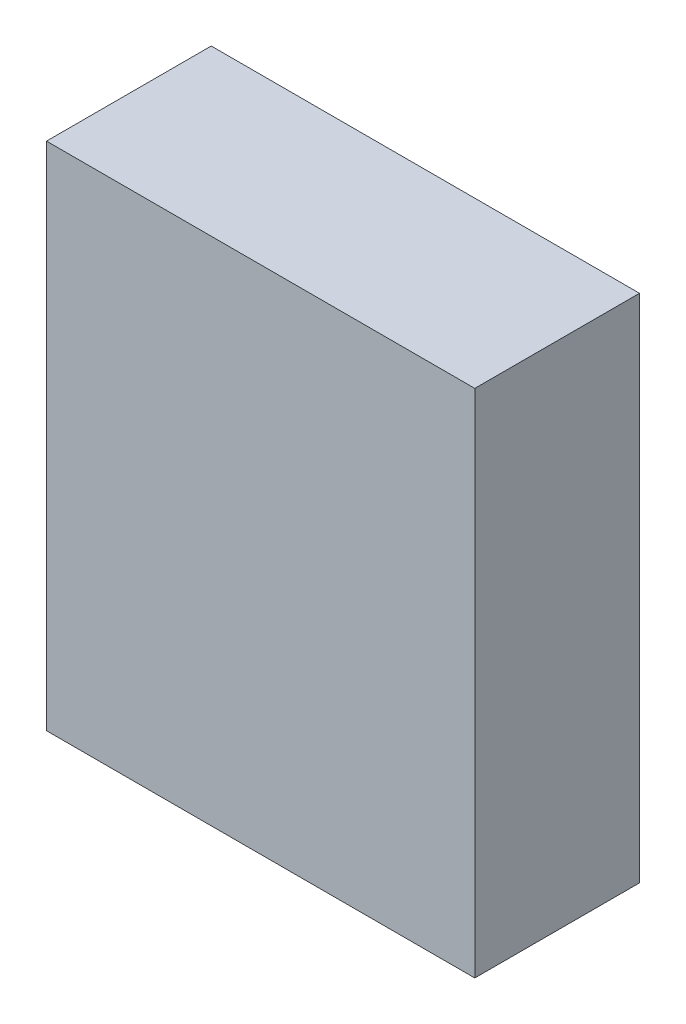
ISO-10303-21;
HEADER;
FILE_DESCRIPTION(('STEP AP214'),'2;1');
FILE_NAME('part.step','',(''),(''),'','','');
FILE_SCHEMA(('AUTOMOTIVE_DESIGN { 1 0 10303 214 1 1 1 1 }'));
ENDSEC;
DATA;
#1=APPLICATION_CONTEXT('core data for automotive mechanical design processes');
#2=APPLICATION_PROTOCOL_DEFINITION('international standard','automotive_design',2000,#1);
#3=PRODUCT_CONTEXT('',#1,'mechanical');
#4=PRODUCT('Part','Part','',(#3));
#5=PRODUCT_RELATED_PRODUCT_CATEGORY('part','',(#4));
#6=PRODUCT_DEFINITION_FORMATION('','',#4);
#7=PRODUCT_DEFINITION_CONTEXT('part definition',#1,'design');
#8=PRODUCT_DEFINITION('design','',#6,#7);
#9=PRODUCT_DEFINITION_SHAPE('','',#8);
#10=(LENGTH_UNIT() NAMED_UNIT(*) SI_UNIT(.MILLI.,.METRE.));
#11=(NAMED_UNIT(*) PLANE_ANGLE_UNIT() SI_UNIT($,.RADIAN.));
#12=(NAMED_UNIT(*) SI_UNIT($,.STERADIAN.) SOLID_ANGLE_UNIT());
#13=UNCERTAINTY_MEASURE_WITH_UNIT(LENGTH_MEASURE(1.E-05),#10,'distance_accuracy_value','');
#14=(GEOMETRIC_REPRESENTATION_CONTEXT(3) GLOBAL_UNCERTAINTY_ASSIGNED_CONTEXT((#13)) GLOBAL_UNIT_ASSIGNED_CONTEXT((#10,
#11,#12)) REPRESENTATION_CONTEXT('',''));
#15=CARTESIAN_POINT('',(0.,0.,0.));
#16=DIRECTION('',(0.,0.,1.));
#17=DIRECTION('',(1.,0.,0.));
#18=AXIS2_PLACEMENT_3D('',#15,#16,#17);
#19=CARTESIAN_POINT('',(0.65000124,-0.77499972,0.499999));
#20=DIRECTION('',(0.,0.,1.));
#21=DIRECTION('',(1.,0.,0.));
#22=AXIS2_PLACEMENT_3D('',#19,#20,#21);
#23=PLANE('',#22);
#24=DIRECTION('',(0.,1.,0.));
#25=VECTOR('',#24,1.);
#26=CARTESIAN_POINT('',(-0.65000124,-0.77499972,0.499999));
#27=LINE('',#26,#25);
#28=CARTESIAN_POINT('',(-0.65000124,-0.77499972,0.499999));
#29=VERTEX_POINT('',#28);
#30=CARTESIAN_POINT('',(-0.65000124,0.77499972,0.499999));
#31=VERTEX_POINT('',#30);
#32=EDGE_CURVE('E53',#29,#31,#27,.T.);
#33=ORIENTED_EDGE('',*,*,#32,.F.);
#34=DIRECTION('',(1.,0.,0.));
#35=VECTOR('',#34,1.);
#36=CARTESIAN_POINT('',(0.65000124,-0.77499972,0.499999));
#37=LINE('',#36,#35);
#38=CARTESIAN_POINT('',(0.65000124,-0.77499972,0.499999));
#39=VERTEX_POINT('',#38);
#40=EDGE_CURVE('E68',#39,#29,#37,.F.);
#41=ORIENTED_EDGE('',*,*,#40,.F.);
#42=DIRECTION('',(0.,1.,0.));
#43=VECTOR('',#42,1.);
#44=CARTESIAN_POINT('',(0.65000124,0.77499972,0.499999));
#45=LINE('',#44,#43);
#46=CARTESIAN_POINT('',(0.65000124,0.77499972,0.499999));
#47=VERTEX_POINT('',#46);
#48=EDGE_CURVE('E20',#47,#39,#45,.F.);
#49=ORIENTED_EDGE('',*,*,#48,.F.);
#50=DIRECTION('',(1.,0.,0.));
#51=VECTOR('',#50,1.);
#52=CARTESIAN_POINT('',(-0.65000124,0.77499972,0.499999));
#53=LINE('',#52,#51);
#54=EDGE_CURVE('E58',#31,#47,#53,.T.);
#55=ORIENTED_EDGE('',*,*,#54,.F.);
#56=EDGE_LOOP('',(#33,#41,#49,#55));
#57=FACE_BOUND('',#56,.T.);
#58=ADVANCED_FACE('F17',(#57),#23,.T.);
#59=CARTESIAN_POINT('',(0.65000124,0.77499972,0.));
#60=DIRECTION('',(1.,0.,0.));
#61=DIRECTION('',(0.,0.,-1.));
#62=AXIS2_PLACEMENT_3D('',#59,#60,#61);
#63=PLANE('',#62);
#64=DIRECTION('',(0.,0.,-1.));
#65=VECTOR('',#64,1.);
#66=CARTESIAN_POINT('',(0.65000124,-0.77499972,0.));
#67=LINE('',#66,#65);
#68=CARTESIAN_POINT('',(0.65000124,-0.77499972,0.));
#69=VERTEX_POINT('',#68);
#70=EDGE_CURVE('E79',#69,#39,#67,.F.);
#71=ORIENTED_EDGE('',*,*,#70,.F.);
#72=DIRECTION('',(0.,1.,0.));
#73=VECTOR('',#72,1.);
#74=CARTESIAN_POINT('',(0.65000124,-0.77499972,0.));
#75=LINE('',#74,#73);
#76=CARTESIAN_POINT('',(0.65000124,0.77499972,0.));
#77=VERTEX_POINT('',#76);
#78=EDGE_CURVE('E74',#69,#77,#75,.T.);
#79=ORIENTED_EDGE('',*,*,#78,.T.);
#80=DIRECTION('',(0.,0.,1.));
#81=VECTOR('',#80,1.);
#82=CARTESIAN_POINT('',(0.65000124,0.77499972,0.));
#83=LINE('',#82,#81);
#84=EDGE_CURVE('E63',#47,#77,#83,.F.);
#85=ORIENTED_EDGE('',*,*,#84,.F.);
#86=ORIENTED_EDGE('',*,*,#48,.T.);
#87=EDGE_LOOP('',(#71,#79,#85,#86));
#88=FACE_BOUND('',#87,.T.);
#89=ADVANCED_FACE('F73',(#88),#63,.T.);
#90=CARTESIAN_POINT('',(-0.65000124,0.77499972,0.));
#91=DIRECTION('',(0.,1.,0.));
#92=DIRECTION('',(0.,0.,1.));
#93=AXIS2_PLACEMENT_3D('',#90,#91,#92);
#94=PLANE('',#93);
#95=ORIENTED_EDGE('',*,*,#84,.T.);
#96=DIRECTION('',(1.,0.,0.));
#97=VECTOR('',#96,1.);
#98=CARTESIAN_POINT('',(0.65000124,0.77499972,0.));
#99=LINE('',#98,#97);
#100=CARTESIAN_POINT('',(-0.65000124,0.77499972,0.));
#101=VERTEX_POINT('',#100);
#102=EDGE_CURVE('E84',#77,#101,#99,.F.);
#103=ORIENTED_EDGE('',*,*,#102,.T.);
#104=DIRECTION('',(0.,0.,1.));
#105=VECTOR('',#104,1.);
#106=CARTESIAN_POINT('',(-0.65000124,0.77499972,0.));
#107=LINE('',#106,#105);
#108=EDGE_CURVE('E65',#31,#101,#107,.F.);
#109=ORIENTED_EDGE('',*,*,#108,.F.);
#110=ORIENTED_EDGE('',*,*,#54,.T.);
#111=EDGE_LOOP('',(#95,#103,#109,#110));
#112=FACE_BOUND('',#111,.T.);
#113=ADVANCED_FACE('F60',(#112),#94,.T.);
#114=CARTESIAN_POINT('',(-0.65000124,-0.77499972,0.));
#115=DIRECTION('',(-1.,0.,0.));
#116=DIRECTION('',(0.,0.,1.));
#117=AXIS2_PLACEMENT_3D('',#114,#115,#116);
#118=PLANE('',#117);
#119=ORIENTED_EDGE('',*,*,#108,.T.);
#120=DIRECTION('',(0.,1.,0.));
#121=VECTOR('',#120,1.);
#122=CARTESIAN_POINT('',(-0.65000124,-0.77499972,0.));
#123=LINE('',#122,#121);
#124=CARTESIAN_POINT('',(-0.65000124,-0.77499972,0.));
#125=VERTEX_POINT('',#124);
#126=EDGE_CURVE('E26',#101,#125,#123,.F.);
#127=ORIENTED_EDGE('',*,*,#126,.T.);
#128=DIRECTION('',(0.,0.,-1.));
#129=VECTOR('',#128,1.);
#130=CARTESIAN_POINT('',(-0.65000124,-0.77499972,0.));
#131=LINE('',#130,#129);
#132=EDGE_CURVE('E34',#29,#125,#131,.T.);
#133=ORIENTED_EDGE('',*,*,#132,.F.);
#134=ORIENTED_EDGE('',*,*,#32,.T.);
#135=EDGE_LOOP('',(#119,#127,#133,#134));
#136=FACE_BOUND('',#135,.T.);
#137=ADVANCED_FACE('F88',(#136),#118,.T.);
#138=CARTESIAN_POINT('',(0.65000124,-0.77499972,0.));
#139=DIRECTION('',(0.,-1.,0.));
#140=DIRECTION('',(0.,0.,-1.));
#141=AXIS2_PLACEMENT_3D('',#138,#139,#140);
#142=PLANE('',#141);
#143=ORIENTED_EDGE('',*,*,#132,.T.);
#144=DIRECTION('',(1.,0.,0.));
#145=VECTOR('',#144,1.);
#146=CARTESIAN_POINT('',(0.65000124,-0.77499972,0.));
#147=LINE('',#146,#145);
#148=EDGE_CURVE('E11',#125,#69,#147,.T.);
#149=ORIENTED_EDGE('',*,*,#148,.T.);
#150=ORIENTED_EDGE('',*,*,#70,.T.);
#151=ORIENTED_EDGE('',*,*,#40,.T.);
#152=EDGE_LOOP('',(#143,#149,#150,#151));
#153=FACE_BOUND('',#152,.T.);
#154=ADVANCED_FACE('F91',(#153),#142,.T.);
#155=CARTESIAN_POINT('',(0.65000124,-0.77499972,0.));
#156=DIRECTION('',(0.,0.,1.));
#157=DIRECTION('',(1.,0.,0.));
#158=AXIS2_PLACEMENT_3D('',#155,#156,#157);
#159=PLANE('',#158);
#160=ORIENTED_EDGE('',*,*,#126,.F.);
#161=ORIENTED_EDGE('',*,*,#102,.F.);
#162=ORIENTED_EDGE('',*,*,#78,.F.);
#163=ORIENTED_EDGE('',*,*,#148,.F.);
#164=EDGE_LOOP('',(#160,#161,#162,#163));
#165=FACE_BOUND('',#164,.T.);
#166=ADVANCED_FACE('F90',(#165),#159,.F.);
#167=CLOSED_SHELL('',(#58,#89,#113,#137,#154,#166));
#168=MANIFOLD_SOLID_BREP('B1',#167);
#169=ADVANCED_BREP_SHAPE_REPRESENTATION('',(#18,#168),#14);
#170=SHAPE_DEFINITION_REPRESENTATION(#9,#169);
ENDSEC;
END-ISO-10303-21;
